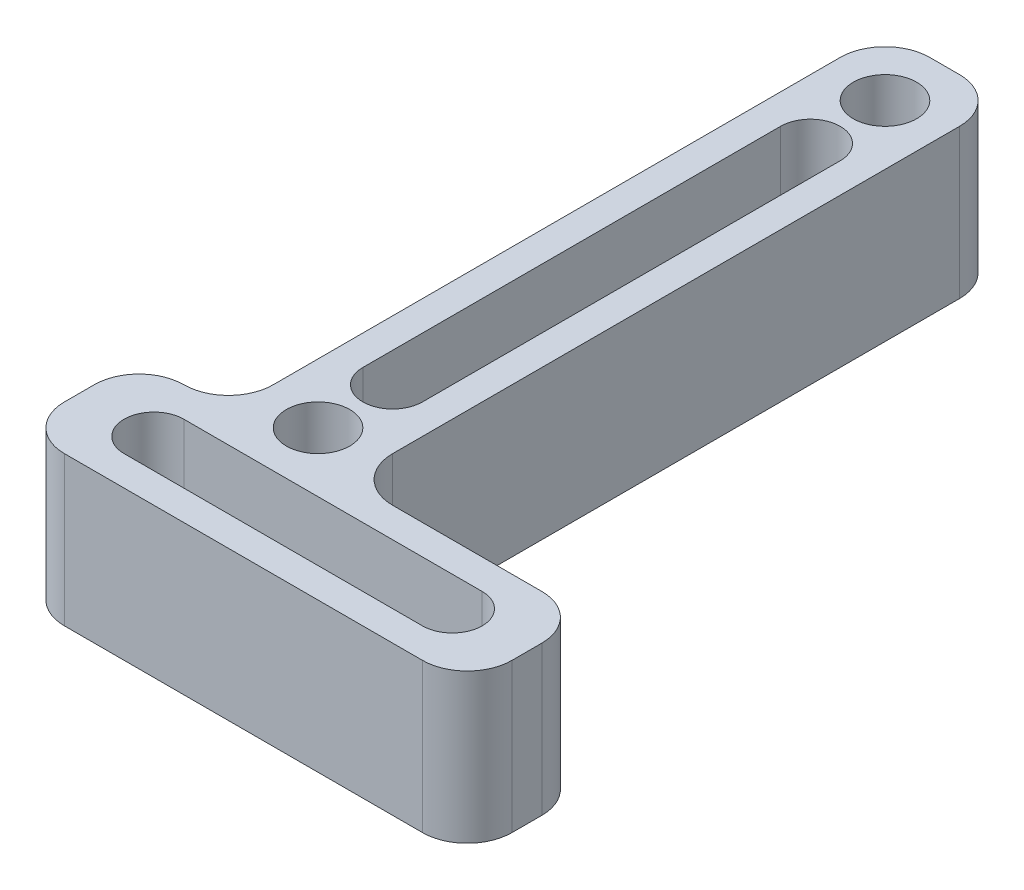
ISO-10303-21;
HEADER;
FILE_DESCRIPTION(('STEP AP214'),'2;1');
FILE_NAME('part.step','',(''),(''),'','','');
FILE_SCHEMA(('AUTOMOTIVE_DESIGN { 1 0 10303 214 1 1 1 1 }'));
ENDSEC;
DATA;
#1=APPLICATION_CONTEXT('core data for automotive mechanical design processes');
#2=APPLICATION_PROTOCOL_DEFINITION('international standard','automotive_design',2000,#1);
#3=PRODUCT_CONTEXT('',#1,'mechanical');
#4=PRODUCT('Part','Part','',(#3));
#5=PRODUCT_RELATED_PRODUCT_CATEGORY('part','',(#4));
#6=PRODUCT_DEFINITION_FORMATION('','',#4);
#7=PRODUCT_DEFINITION_CONTEXT('part definition',#1,'design');
#8=PRODUCT_DEFINITION('design','',#6,#7);
#9=PRODUCT_DEFINITION_SHAPE('','',#8);
#10=(LENGTH_UNIT() NAMED_UNIT(*) SI_UNIT(.MILLI.,.METRE.));
#11=(NAMED_UNIT(*) PLANE_ANGLE_UNIT() SI_UNIT($,.RADIAN.));
#12=(NAMED_UNIT(*) SI_UNIT($,.STERADIAN.) SOLID_ANGLE_UNIT());
#13=UNCERTAINTY_MEASURE_WITH_UNIT(LENGTH_MEASURE(1.E-05),#10,'distance_accuracy_value','');
#14=(GEOMETRIC_REPRESENTATION_CONTEXT(3) GLOBAL_UNCERTAINTY_ASSIGNED_CONTEXT((#13)) GLOBAL_UNIT_ASSIGNED_CONTEXT((#10,
#11,#12)) REPRESENTATION_CONTEXT('',''));
#15=CARTESIAN_POINT('',(0.,0.,0.));
#16=DIRECTION('',(0.,0.,1.));
#17=DIRECTION('',(1.,0.,0.));
#18=AXIS2_PLACEMENT_3D('',#15,#16,#17);
#19=CARTESIAN_POINT('',(-8.,20.,44.));
#20=DIRECTION('',(1.,0.,0.));
#21=DIRECTION('',(0.,0.,-1.));
#22=AXIS2_PLACEMENT_3D('',#19,#20,#21);
#23=PLANE('',#22);
#24=DIRECTION('',(0.,0.,1.));
#25=VECTOR('',#24,1.);
#26=CARTESIAN_POINT('',(-8.,20.,44.));
#27=LINE('',#26,#25);
#28=CARTESIAN_POINT('',(-8.,20.,-38.));
#29=VERTEX_POINT('',#28);
#30=CARTESIAN_POINT('',(-8.,20.,38.));
#31=VERTEX_POINT('',#30);
#32=EDGE_CURVE('E269',#29,#31,#27,.T.);
#33=ORIENTED_EDGE('',*,*,#32,.F.);
#34=DIRECTION('',(0.,-1.,0.));
#35=VECTOR('',#34,1.);
#36=CARTESIAN_POINT('',(-8.,20.,-38.));
#37=LINE('',#36,#35);
#38=CARTESIAN_POINT('',(-8.,0.,-38.));
#39=VERTEX_POINT('',#38);
#40=EDGE_CURVE('E378',#29,#39,#37,.T.);
#41=ORIENTED_EDGE('',*,*,#40,.T.);
#42=DIRECTION('',(0.,0.,1.));
#43=VECTOR('',#42,1.);
#44=CARTESIAN_POINT('',(-8.,0.,44.));
#45=LINE('',#44,#43);
#46=CARTESIAN_POINT('',(-8.,0.,38.));
#47=VERTEX_POINT('',#46);
#48=EDGE_CURVE('E265',#39,#47,#45,.T.);
#49=ORIENTED_EDGE('',*,*,#48,.T.);
#50=DIRECTION('',(0.,-1.,0.));
#51=VECTOR('',#50,1.);
#52=CARTESIAN_POINT('',(-8.,20.,38.));
#53=LINE('',#52,#51);
#54=EDGE_CURVE('E375',#47,#31,#53,.F.);
#55=ORIENTED_EDGE('',*,*,#54,.T.);
#56=EDGE_LOOP('',(#33,#41,#49,#55));
#57=FACE_BOUND('',#56,.T.);
#58=ADVANCED_FACE('F39',(#57),#23,.F.);
#59=CARTESIAN_POINT('',(-20.,20.,60.));
#60=DIRECTION('',(1.,0.,0.));
#61=DIRECTION('',(0.,0.,-1.));
#62=AXIS2_PLACEMENT_3D('',#59,#60,#61);
#63=PLANE('',#62);
#64=DIRECTION('',(0.,0.,1.));
#65=VECTOR('',#64,1.);
#66=CARTESIAN_POINT('',(-20.,0.,60.));
#67=LINE('',#66,#65);
#68=CARTESIAN_POINT('',(-20.,0.,50.));
#69=VERTEX_POINT('',#68);
#70=CARTESIAN_POINT('',(-20.,0.,54.));
#71=VERTEX_POINT('',#70);
#72=EDGE_CURVE('E294',#69,#71,#67,.T.);
#73=ORIENTED_EDGE('',*,*,#72,.T.);
#74=DIRECTION('',(0.,-1.,0.));
#75=VECTOR('',#74,1.);
#76=CARTESIAN_POINT('',(-20.,20.,54.));
#77=LINE('',#76,#75);
#78=CARTESIAN_POINT('',(-20.,20.,54.));
#79=VERTEX_POINT('',#78);
#80=EDGE_CURVE('E358',#71,#79,#77,.F.);
#81=ORIENTED_EDGE('',*,*,#80,.T.);
#82=DIRECTION('',(0.,0.,1.));
#83=VECTOR('',#82,1.);
#84=CARTESIAN_POINT('',(-20.,20.,60.));
#85=LINE('',#84,#83);
#86=CARTESIAN_POINT('',(-20.,20.,50.));
#87=VERTEX_POINT('',#86);
#88=EDGE_CURVE('E272',#87,#79,#85,.T.);
#89=ORIENTED_EDGE('',*,*,#88,.F.);
#90=DIRECTION('',(0.,-1.,0.));
#91=VECTOR('',#90,1.);
#92=CARTESIAN_POINT('',(-20.,20.,50.));
#93=LINE('',#92,#91);
#94=EDGE_CURVE('E356',#87,#69,#93,.T.);
#95=ORIENTED_EDGE('',*,*,#94,.T.);
#96=EDGE_LOOP('',(#73,#81,#89,#95));
#97=FACE_BOUND('',#96,.T.);
#98=ADVANCED_FACE('F406',(#97),#63,.F.);
#99=CARTESIAN_POINT('',(40.,20.,60.));
#100=DIRECTION('',(0.,0.,-1.));
#101=DIRECTION('',(-1.,0.,0.));
#102=AXIS2_PLACEMENT_3D('',#99,#100,#101);
#103=PLANE('',#102);
#104=DIRECTION('',(1.,0.,0.));
#105=VECTOR('',#104,1.);
#106=CARTESIAN_POINT('',(40.,0.,60.));
#107=LINE('',#106,#105);
#108=CARTESIAN_POINT('',(-14.,0.,60.));
#109=VERTEX_POINT('',#108);
#110=CARTESIAN_POINT('',(34.,0.,60.));
#111=VERTEX_POINT('',#110);
#112=EDGE_CURVE('E297',#109,#111,#107,.T.);
#113=ORIENTED_EDGE('',*,*,#112,.T.);
#114=DIRECTION('',(0.,-1.,0.));
#115=VECTOR('',#114,1.);
#116=CARTESIAN_POINT('',(34.,20.,60.));
#117=LINE('',#116,#115);
#118=CARTESIAN_POINT('',(34.,20.,60.));
#119=VERTEX_POINT('',#118);
#120=EDGE_CURVE('E342',#111,#119,#117,.F.);
#121=ORIENTED_EDGE('',*,*,#120,.T.);
#122=DIRECTION('',(1.,0.,0.));
#123=VECTOR('',#122,1.);
#124=CARTESIAN_POINT('',(40.,20.,60.));
#125=LINE('',#124,#123);
#126=CARTESIAN_POINT('',(-14.,20.,60.));
#127=VERTEX_POINT('',#126);
#128=EDGE_CURVE('E276',#127,#119,#125,.T.);
#129=ORIENTED_EDGE('',*,*,#128,.F.);
#130=DIRECTION('',(0.,-1.,0.));
#131=VECTOR('',#130,1.);
#132=CARTESIAN_POINT('',(-14.,20.,60.));
#133=LINE('',#132,#131);
#134=EDGE_CURVE('E339',#127,#109,#133,.T.);
#135=ORIENTED_EDGE('',*,*,#134,.T.);
#136=EDGE_LOOP('',(#113,#121,#129,#135));
#137=FACE_BOUND('',#136,.T.);
#138=ADVANCED_FACE('F415',(#137),#103,.F.);
#139=CARTESIAN_POINT('',(40.,20.,44.));
#140=DIRECTION('',(-1.,0.,0.));
#141=DIRECTION('',(0.,0.,1.));
#142=AXIS2_PLACEMENT_3D('',#139,#140,#141);
#143=PLANE('',#142);
#144=DIRECTION('',(0.,0.,-1.));
#145=VECTOR('',#144,1.);
#146=CARTESIAN_POINT('',(40.,20.,44.));
#147=LINE('',#146,#145);
#148=CARTESIAN_POINT('',(40.,20.,54.));
#149=VERTEX_POINT('',#148);
#150=CARTESIAN_POINT('',(40.,20.,50.));
#151=VERTEX_POINT('',#150);
#152=EDGE_CURVE('E279',#149,#151,#147,.T.);
#153=ORIENTED_EDGE('',*,*,#152,.F.);
#154=DIRECTION('',(0.,-1.,0.));
#155=VECTOR('',#154,1.);
#156=CARTESIAN_POINT('',(40.,20.,54.));
#157=LINE('',#156,#155);
#158=CARTESIAN_POINT('',(40.,0.,54.));
#159=VERTEX_POINT('',#158);
#160=EDGE_CURVE('E324',#149,#159,#157,.T.);
#161=ORIENTED_EDGE('',*,*,#160,.T.);
#162=DIRECTION('',(0.,0.,-1.));
#163=VECTOR('',#162,1.);
#164=CARTESIAN_POINT('',(40.,0.,44.));
#165=LINE('',#164,#163);
#166=CARTESIAN_POINT('',(40.,0.,50.));
#167=VERTEX_POINT('',#166);
#168=EDGE_CURVE('E300',#159,#167,#165,.T.);
#169=ORIENTED_EDGE('',*,*,#168,.T.);
#170=DIRECTION('',(0.,-1.,0.));
#171=VECTOR('',#170,1.);
#172=CARTESIAN_POINT('',(40.,20.,50.));
#173=LINE('',#172,#171);
#174=EDGE_CURVE('E322',#167,#151,#173,.F.);
#175=ORIENTED_EDGE('',*,*,#174,.T.);
#176=EDGE_LOOP('',(#153,#161,#169,#175));
#177=FACE_BOUND('',#176,.T.);
#178=ADVANCED_FACE('F423',(#177),#143,.F.);
#179=CARTESIAN_POINT('',(8.,20.,44.));
#180=DIRECTION('',(0.,0.,1.));
#181=DIRECTION('',(1.,0.,0.));
#182=AXIS2_PLACEMENT_3D('',#179,#180,#181);
#183=PLANE('',#182);
#184=DIRECTION('',(-1.,0.,0.));
#185=VECTOR('',#184,1.);
#186=CARTESIAN_POINT('',(8.,20.,44.));
#187=LINE('',#186,#185);
#188=CARTESIAN_POINT('',(34.,20.,44.));
#189=VERTEX_POINT('',#188);
#190=CARTESIAN_POINT('',(14.,20.,44.));
#191=VERTEX_POINT('',#190);
#192=EDGE_CURVE('E282',#189,#191,#187,.T.);
#193=ORIENTED_EDGE('',*,*,#192,.F.);
#194=DIRECTION('',(0.,-1.,0.));
#195=VECTOR('',#194,1.);
#196=CARTESIAN_POINT('',(34.,20.,44.));
#197=LINE('',#196,#195);
#198=CARTESIAN_POINT('',(34.,0.,44.));
#199=VERTEX_POINT('',#198);
#200=EDGE_CURVE('E362',#189,#199,#197,.T.);
#201=ORIENTED_EDGE('',*,*,#200,.T.);
#202=DIRECTION('',(-1.,0.,0.));
#203=VECTOR('',#202,1.);
#204=CARTESIAN_POINT('',(8.,0.,44.));
#205=LINE('',#204,#203);
#206=CARTESIAN_POINT('',(14.,0.,44.));
#207=VERTEX_POINT('',#206);
#208=EDGE_CURVE('E303',#199,#207,#205,.T.);
#209=ORIENTED_EDGE('',*,*,#208,.T.);
#210=DIRECTION('',(0.,-1.,0.));
#211=VECTOR('',#210,1.);
#212=CARTESIAN_POINT('',(14.,20.,44.));
#213=LINE('',#212,#211);
#214=EDGE_CURVE('E360',#207,#191,#213,.F.);
#215=ORIENTED_EDGE('',*,*,#214,.T.);
#216=EDGE_LOOP('',(#193,#201,#209,#215));
#217=FACE_BOUND('',#216,.T.);
#218=ADVANCED_FACE('F432',(#217),#183,.F.);
#219=CARTESIAN_POINT('',(8.,20.,-44.));
#220=DIRECTION('',(-1.,0.,0.));
#221=DIRECTION('',(0.,0.,1.));
#222=AXIS2_PLACEMENT_3D('',#219,#220,#221);
#223=PLANE('',#222);
#224=DIRECTION('',(0.,0.,-1.));
#225=VECTOR('',#224,1.);
#226=CARTESIAN_POINT('',(8.,20.,-44.));
#227=LINE('',#226,#225);
#228=CARTESIAN_POINT('',(8.,20.,38.));
#229=VERTEX_POINT('',#228);
#230=CARTESIAN_POINT('',(8.,20.,-38.));
#231=VERTEX_POINT('',#230);
#232=EDGE_CURVE('E285',#229,#231,#227,.T.);
#233=ORIENTED_EDGE('',*,*,#232,.F.);
#234=DIRECTION('',(0.,-1.,0.));
#235=VECTOR('',#234,1.);
#236=CARTESIAN_POINT('',(8.,0.,38.));
#237=LINE('',#236,#235);
#238=CARTESIAN_POINT('',(8.,0.,38.));
#239=VERTEX_POINT('',#238);
#240=EDGE_CURVE('E367',#229,#239,#237,.T.);
#241=ORIENTED_EDGE('',*,*,#240,.T.);
#242=DIRECTION('',(0.,0.,-1.));
#243=VECTOR('',#242,1.);
#244=CARTESIAN_POINT('',(8.,0.,-44.));
#245=LINE('',#244,#243);
#246=CARTESIAN_POINT('',(8.,0.,-38.));
#247=VERTEX_POINT('',#246);
#248=EDGE_CURVE('E306',#239,#247,#245,.T.);
#249=ORIENTED_EDGE('',*,*,#248,.T.);
#250=DIRECTION('',(0.,-1.,0.));
#251=VECTOR('',#250,1.);
#252=CARTESIAN_POINT('',(8.,20.,-38.));
#253=LINE('',#252,#251);
#254=EDGE_CURVE('E365',#247,#231,#253,.F.);
#255=ORIENTED_EDGE('',*,*,#254,.T.);
#256=EDGE_LOOP('',(#233,#241,#249,#255));
#257=FACE_BOUND('',#256,.T.);
#258=ADVANCED_FACE('F441',(#257),#223,.F.);
#259=CARTESIAN_POINT('',(-8.,20.,-44.));
#260=DIRECTION('',(0.,0.,1.));
#261=DIRECTION('',(1.,0.,0.));
#262=AXIS2_PLACEMENT_3D('',#259,#260,#261);
#263=PLANE('',#262);
#264=DIRECTION('',(-1.,0.,0.));
#265=VECTOR('',#264,1.);
#266=CARTESIAN_POINT('',(-8.,20.,-44.));
#267=LINE('',#266,#265);
#268=CARTESIAN_POINT('',(1.99999999999999,20.,-44.));
#269=VERTEX_POINT('',#268);
#270=CARTESIAN_POINT('',(-2.00000000000001,20.,-44.));
#271=VERTEX_POINT('',#270);
#272=EDGE_CURVE('E288',#269,#271,#267,.T.);
#273=ORIENTED_EDGE('',*,*,#272,.F.);
#274=DIRECTION('',(0.,-1.,0.));
#275=VECTOR('',#274,1.);
#276=CARTESIAN_POINT('',(1.99999999999999,20.,-44.));
#277=LINE('',#276,#275);
#278=CARTESIAN_POINT('',(1.99999999999999,0.,-44.));
#279=VERTEX_POINT('',#278);
#280=EDGE_CURVE('E372',#269,#279,#277,.T.);
#281=ORIENTED_EDGE('',*,*,#280,.T.);
#282=DIRECTION('',(-1.,0.,0.));
#283=VECTOR('',#282,1.);
#284=CARTESIAN_POINT('',(-8.,0.,-44.));
#285=LINE('',#284,#283);
#286=CARTESIAN_POINT('',(-2.00000000000001,0.,-44.));
#287=VERTEX_POINT('',#286);
#288=EDGE_CURVE('E273',#279,#287,#285,.T.);
#289=ORIENTED_EDGE('',*,*,#288,.T.);
#290=DIRECTION('',(0.,-1.,0.));
#291=VECTOR('',#290,1.);
#292=CARTESIAN_POINT('',(-2.00000000000001,20.,-44.));
#293=LINE('',#292,#291);
#294=EDGE_CURVE('E370',#287,#271,#293,.F.);
#295=ORIENTED_EDGE('',*,*,#294,.T.);
#296=EDGE_LOOP('',(#273,#281,#289,#295));
#297=FACE_BOUND('',#296,.T.);
#298=ADVANCED_FACE('F450',(#297),#263,.F.);
#299=CARTESIAN_POINT('',(0.,20.,0.));
#300=DIRECTION('',(0.,-1.,0.));
#301=DIRECTION('',(0.,0.,-1.));
#302=AXIS2_PLACEMENT_3D('',#299,#300,#301);
#303=PLANE('',#302);
#304=DIRECTION('',(1.,0.,0.));
#305=VECTOR('',#304,1.);
#306=CARTESIAN_POINT('',(-10.,20.,56.));
#307=LINE('',#306,#305);
#308=CARTESIAN_POINT('',(-10.,20.,56.));
#309=VERTEX_POINT('',#308);
#310=CARTESIAN_POINT('',(30.,20.,56.));
#311=VERTEX_POINT('',#310);
#312=EDGE_CURVE('E221',#309,#311,#307,.T.);
#313=ORIENTED_EDGE('',*,*,#312,.F.);
#314=CARTESIAN_POINT('',(-10.,20.,52.));
#315=DIRECTION('',(0.,1.,0.));
#316=DIRECTION('',(0.,0.,1.));
#317=AXIS2_PLACEMENT_3D('',#314,#315,#316);
#318=CIRCLE('',#317,3.99999999999999);
#319=CARTESIAN_POINT('',(-10.,20.,48.));
#320=VERTEX_POINT('',#319);
#321=EDGE_CURVE('E55',#320,#309,#318,.T.);
#322=ORIENTED_EDGE('',*,*,#321,.F.);
#323=DIRECTION('',(-1.,0.,0.));
#324=VECTOR('',#323,1.);
#325=CARTESIAN_POINT('',(-10.,20.,48.));
#326=LINE('',#325,#324);
#327=CARTESIAN_POINT('',(30.,20.,48.));
#328=VERTEX_POINT('',#327);
#329=EDGE_CURVE('E212',#328,#320,#326,.T.);
#330=ORIENTED_EDGE('',*,*,#329,.F.);
#331=CARTESIAN_POINT('',(30.,20.,52.));
#332=DIRECTION('',(0.,1.,0.));
#333=DIRECTION('',(0.,0.,1.));
#334=AXIS2_PLACEMENT_3D('',#331,#332,#333);
#335=CIRCLE('',#334,3.99999999999999);
#336=EDGE_CURVE('E215',#311,#328,#335,.T.);
#337=ORIENTED_EDGE('',*,*,#336,.F.);
#338=EDGE_LOOP('',(#313,#322,#330,#337));
#339=FACE_BOUND('',#338,.T.);
#340=DIRECTION('',(0.,0.,1.));
#341=VECTOR('',#340,1.);
#342=CARTESIAN_POINT('',(-3.99999999999999,20.,-26.));
#343=LINE('',#342,#341);
#344=CARTESIAN_POINT('',(-3.99999999999999,20.,-26.));
#345=VERTEX_POINT('',#344);
#346=CARTESIAN_POINT('',(-3.99999999999999,20.,30.));
#347=VERTEX_POINT('',#346);
#348=EDGE_CURVE('E246',#345,#347,#343,.T.);
#349=ORIENTED_EDGE('',*,*,#348,.F.);
#350=CARTESIAN_POINT('',(0.,20.,-26.));
#351=DIRECTION('',(0.,1.,0.));
#352=DIRECTION('',(0.,0.,1.));
#353=AXIS2_PLACEMENT_3D('',#350,#351,#352);
#354=CIRCLE('',#353,4.);
#355=CARTESIAN_POINT('',(4.,20.,-26.));
#356=VERTEX_POINT('',#355);
#357=EDGE_CURVE('E227',#356,#345,#354,.T.);
#358=ORIENTED_EDGE('',*,*,#357,.F.);
#359=DIRECTION('',(0.,0.,-1.));
#360=VECTOR('',#359,1.);
#361=CARTESIAN_POINT('',(4.,20.,-26.));
#362=LINE('',#361,#360);
#363=CARTESIAN_POINT('',(4.00000000000001,20.,30.));
#364=VERTEX_POINT('',#363);
#365=EDGE_CURVE('E235',#364,#356,#362,.T.);
#366=ORIENTED_EDGE('',*,*,#365,.F.);
#367=CARTESIAN_POINT('',(0.,20.,30.));
#368=DIRECTION('',(0.,1.,0.));
#369=DIRECTION('',(0.,0.,1.));
#370=AXIS2_PLACEMENT_3D('',#367,#368,#369);
#371=CIRCLE('',#370,4.);
#372=EDGE_CURVE('E249',#347,#364,#371,.T.);
#373=ORIENTED_EDGE('',*,*,#372,.F.);
#374=EDGE_LOOP('',(#349,#358,#366,#373));
#375=FACE_BOUND('',#374,.T.);
#376=CARTESIAN_POINT('',(0.,20.,-36.));
#377=DIRECTION('',(0.,1.,0.));
#378=DIRECTION('',(0.,0.,1.));
#379=AXIS2_PLACEMENT_3D('',#376,#377,#378);
#380=CIRCLE('',#379,4.25000000000001);
#381=CARTESIAN_POINT('',(0.,20.,-31.75));
#382=VERTEX_POINT('',#381);
#383=EDGE_CURVE('E262',#382,#382,#380,.T.);
#384=ORIENTED_EDGE('',*,*,#383,.F.);
#385=EDGE_LOOP('',(#384));
#386=FACE_BOUND('',#385,.T.);
#387=CARTESIAN_POINT('',(0.,20.,40.));
#388=DIRECTION('',(0.,1.,0.));
#389=DIRECTION('',(0.,0.,1.));
#390=AXIS2_PLACEMENT_3D('',#387,#388,#389);
#391=CIRCLE('',#390,4.25);
#392=CARTESIAN_POINT('',(0.,20.,44.25));
#393=VERTEX_POINT('',#392);
#394=EDGE_CURVE('E266',#393,#393,#391,.T.);
#395=ORIENTED_EDGE('',*,*,#394,.F.);
#396=EDGE_LOOP('',(#395));
#397=FACE_BOUND('',#396,.T.);
#398=ORIENTED_EDGE('',*,*,#128,.T.);
#399=CARTESIAN_POINT('',(34.,20.,54.));
#400=DIRECTION('',(0.,-1.,0.));
#401=DIRECTION('',(0.,0.,-1.));
#402=AXIS2_PLACEMENT_3D('',#399,#400,#401);
#403=CIRCLE('',#402,6.);
#404=EDGE_CURVE('E354',#119,#149,#403,.F.);
#405=ORIENTED_EDGE('',*,*,#404,.T.);
#406=ORIENTED_EDGE('',*,*,#152,.T.);
#407=CARTESIAN_POINT('',(34.,20.,50.));
#408=DIRECTION('',(0.,-1.,0.));
#409=DIRECTION('',(0.,0.,-1.));
#410=AXIS2_PLACEMENT_3D('',#407,#408,#409);
#411=CIRCLE('',#410,6.);
#412=EDGE_CURVE('E350',#151,#189,#411,.F.);
#413=ORIENTED_EDGE('',*,*,#412,.T.);
#414=ORIENTED_EDGE('',*,*,#192,.T.);
#415=CARTESIAN_POINT('',(14.,20.,38.));
#416=DIRECTION('',(0.,-1.,0.));
#417=DIRECTION('',(0.,0.,-1.));
#418=AXIS2_PLACEMENT_3D('',#415,#416,#417);
#419=CIRCLE('',#418,6.);
#420=EDGE_CURVE('E383',#191,#229,#419,.T.);
#421=ORIENTED_EDGE('',*,*,#420,.T.);
#422=ORIENTED_EDGE('',*,*,#232,.T.);
#423=CARTESIAN_POINT('',(2.,20.,-38.));
#424=DIRECTION('',(0.,-1.,0.));
#425=DIRECTION('',(0.,0.,-1.));
#426=AXIS2_PLACEMENT_3D('',#423,#424,#425);
#427=CIRCLE('',#426,6.);
#428=EDGE_CURVE('E348',#231,#269,#427,.F.);
#429=ORIENTED_EDGE('',*,*,#428,.T.);
#430=ORIENTED_EDGE('',*,*,#272,.T.);
#431=CARTESIAN_POINT('',(-2.,20.,-38.));
#432=DIRECTION('',(0.,-1.,0.));
#433=DIRECTION('',(0.,0.,-1.));
#434=AXIS2_PLACEMENT_3D('',#431,#432,#433);
#435=CIRCLE('',#434,6.);
#436=EDGE_CURVE('E346',#271,#29,#435,.F.);
#437=ORIENTED_EDGE('',*,*,#436,.T.);
#438=ORIENTED_EDGE('',*,*,#32,.T.);
#439=CARTESIAN_POINT('',(-14.,20.,38.));
#440=DIRECTION('',(0.,-1.,0.));
#441=DIRECTION('',(0.,0.,-1.));
#442=AXIS2_PLACEMENT_3D('',#439,#440,#441);
#443=CIRCLE('',#442,6.);
#444=CARTESIAN_POINT('',(-14.,20.,44.));
#445=VERTEX_POINT('',#444);
#446=EDGE_CURVE('E11',#31,#445,#443,.T.);
#447=ORIENTED_EDGE('',*,*,#446,.T.);
#448=CARTESIAN_POINT('',(-14.,20.,50.));
#449=DIRECTION('',(0.,-1.,0.));
#450=DIRECTION('',(0.,0.,-1.));
#451=AXIS2_PLACEMENT_3D('',#448,#449,#450);
#452=CIRCLE('',#451,6.);
#453=EDGE_CURVE('E344',#445,#87,#452,.F.);
#454=ORIENTED_EDGE('',*,*,#453,.T.);
#455=ORIENTED_EDGE('',*,*,#88,.T.);
#456=CARTESIAN_POINT('',(-14.,20.,54.));
#457=DIRECTION('',(0.,-1.,0.));
#458=DIRECTION('',(0.,0.,-1.));
#459=AXIS2_PLACEMENT_3D('',#456,#457,#458);
#460=CIRCLE('',#459,6.);
#461=EDGE_CURVE('E352',#79,#127,#460,.F.);
#462=ORIENTED_EDGE('',*,*,#461,.T.);
#463=EDGE_LOOP('',(#398,#405,#406,#413,#414,#421,#422,#429,#430,#437,#438,#447,#454,#455,#462));
#464=FACE_BOUND('',#463,.T.);
#465=ADVANCED_FACE('F401',(#339,#375,#386,#397,#464),#303,.F.);
#466=CARTESIAN_POINT('',(0.,0.,0.));
#467=DIRECTION('',(0.,-1.,0.));
#468=DIRECTION('',(0.,0.,-1.));
#469=AXIS2_PLACEMENT_3D('',#466,#467,#468);
#470=PLANE('',#469);
#471=CARTESIAN_POINT('',(-10.,0.,52.));
#472=DIRECTION('',(0.,1.,0.));
#473=DIRECTION('',(0.,0.,1.));
#474=AXIS2_PLACEMENT_3D('',#471,#472,#473);
#475=CIRCLE('',#474,3.99999999999999);
#476=CARTESIAN_POINT('',(-10.,0.,48.));
#477=VERTEX_POINT('',#476);
#478=CARTESIAN_POINT('',(-10.,0.,56.));
#479=VERTEX_POINT('',#478);
#480=EDGE_CURVE('E196',#477,#479,#475,.T.);
#481=ORIENTED_EDGE('',*,*,#480,.T.);
#482=DIRECTION('',(1.,0.,0.));
#483=VECTOR('',#482,1.);
#484=CARTESIAN_POINT('',(-10.,0.,56.));
#485=LINE('',#484,#483);
#486=CARTESIAN_POINT('',(30.,0.,56.));
#487=VERTEX_POINT('',#486);
#488=EDGE_CURVE('E205',#479,#487,#485,.T.);
#489=ORIENTED_EDGE('',*,*,#488,.T.);
#490=CARTESIAN_POINT('',(30.,0.,52.));
#491=DIRECTION('',(0.,1.,0.));
#492=DIRECTION('',(0.,0.,1.));
#493=AXIS2_PLACEMENT_3D('',#490,#491,#492);
#494=CIRCLE('',#493,3.99999999999999);
#495=CARTESIAN_POINT('',(30.,0.,48.));
#496=VERTEX_POINT('',#495);
#497=EDGE_CURVE('E63',#487,#496,#494,.T.);
#498=ORIENTED_EDGE('',*,*,#497,.T.);
#499=DIRECTION('',(-1.,0.,0.));
#500=VECTOR('',#499,1.);
#501=CARTESIAN_POINT('',(-10.,0.,48.));
#502=LINE('',#501,#500);
#503=EDGE_CURVE('E202',#496,#477,#502,.T.);
#504=ORIENTED_EDGE('',*,*,#503,.T.);
#505=EDGE_LOOP('',(#481,#489,#498,#504));
#506=FACE_BOUND('',#505,.T.);
#507=CARTESIAN_POINT('',(0.,0.,-26.));
#508=DIRECTION('',(0.,1.,0.));
#509=DIRECTION('',(0.,0.,1.));
#510=AXIS2_PLACEMENT_3D('',#507,#508,#509);
#511=CIRCLE('',#510,4.);
#512=CARTESIAN_POINT('',(4.,0.,-26.));
#513=VERTEX_POINT('',#512);
#514=CARTESIAN_POINT('',(-3.99999999999999,0.,-26.));
#515=VERTEX_POINT('',#514);
#516=EDGE_CURVE('E231',#513,#515,#511,.T.);
#517=ORIENTED_EDGE('',*,*,#516,.T.);
#518=DIRECTION('',(0.,0.,1.));
#519=VECTOR('',#518,1.);
#520=CARTESIAN_POINT('',(-3.99999999999999,0.,-26.));
#521=LINE('',#520,#519);
#522=CARTESIAN_POINT('',(-3.99999999999999,0.,30.));
#523=VERTEX_POINT('',#522);
#524=EDGE_CURVE('E234',#515,#523,#521,.T.);
#525=ORIENTED_EDGE('',*,*,#524,.T.);
#526=CARTESIAN_POINT('',(0.,0.,30.));
#527=DIRECTION('',(0.,1.,0.));
#528=DIRECTION('',(0.,0.,1.));
#529=AXIS2_PLACEMENT_3D('',#526,#527,#528);
#530=CIRCLE('',#529,4.);
#531=CARTESIAN_POINT('',(4.00000000000001,0.,30.));
#532=VERTEX_POINT('',#531);
#533=EDGE_CURVE('E238',#523,#532,#530,.T.);
#534=ORIENTED_EDGE('',*,*,#533,.T.);
#535=DIRECTION('',(0.,0.,-1.));
#536=VECTOR('',#535,1.);
#537=CARTESIAN_POINT('',(4.,0.,-26.));
#538=LINE('',#537,#536);
#539=EDGE_CURVE('E241',#532,#513,#538,.T.);
#540=ORIENTED_EDGE('',*,*,#539,.T.);
#541=EDGE_LOOP('',(#517,#525,#534,#540));
#542=FACE_BOUND('',#541,.T.);
#543=ORIENTED_EDGE('',*,*,#168,.F.);
#544=CARTESIAN_POINT('',(34.,0.,54.));
#545=DIRECTION('',(0.,-1.,0.));
#546=DIRECTION('',(0.,0.,-1.));
#547=AXIS2_PLACEMENT_3D('',#544,#545,#546);
#548=CIRCLE('',#547,6.);
#549=EDGE_CURVE('E337',#159,#111,#548,.T.);
#550=ORIENTED_EDGE('',*,*,#549,.T.);
#551=ORIENTED_EDGE('',*,*,#112,.F.);
#552=CARTESIAN_POINT('',(-14.,0.,54.));
#553=DIRECTION('',(0.,-1.,0.));
#554=DIRECTION('',(0.,0.,-1.));
#555=AXIS2_PLACEMENT_3D('',#552,#553,#554);
#556=CIRCLE('',#555,6.);
#557=EDGE_CURVE('E335',#109,#71,#556,.T.);
#558=ORIENTED_EDGE('',*,*,#557,.T.);
#559=ORIENTED_EDGE('',*,*,#72,.F.);
#560=CARTESIAN_POINT('',(-14.,0.,50.));
#561=DIRECTION('',(0.,-1.,0.));
#562=DIRECTION('',(0.,0.,-1.));
#563=AXIS2_PLACEMENT_3D('',#560,#561,#562);
#564=CIRCLE('',#563,6.);
#565=CARTESIAN_POINT('',(-14.,0.,44.));
#566=VERTEX_POINT('',#565);
#567=EDGE_CURVE('E327',#69,#566,#564,.T.);
#568=ORIENTED_EDGE('',*,*,#567,.T.);
#569=CARTESIAN_POINT('',(-14.,0.,38.));
#570=DIRECTION('',(0.,-1.,0.));
#571=DIRECTION('',(0.,0.,-1.));
#572=AXIS2_PLACEMENT_3D('',#569,#570,#571);
#573=CIRCLE('',#572,6.);
#574=EDGE_CURVE('E48',#566,#47,#573,.F.);
#575=ORIENTED_EDGE('',*,*,#574,.T.);
#576=ORIENTED_EDGE('',*,*,#48,.F.);
#577=CARTESIAN_POINT('',(-2.,0.,-38.));
#578=DIRECTION('',(0.,-1.,0.));
#579=DIRECTION('',(0.,0.,-1.));
#580=AXIS2_PLACEMENT_3D('',#577,#578,#579);
#581=CIRCLE('',#580,6.);
#582=EDGE_CURVE('E329',#39,#287,#581,.T.);
#583=ORIENTED_EDGE('',*,*,#582,.T.);
#584=ORIENTED_EDGE('',*,*,#288,.F.);
#585=CARTESIAN_POINT('',(2.,0.,-38.));
#586=DIRECTION('',(0.,-1.,0.));
#587=DIRECTION('',(0.,0.,-1.));
#588=AXIS2_PLACEMENT_3D('',#585,#586,#587);
#589=CIRCLE('',#588,6.);
#590=EDGE_CURVE('E331',#279,#247,#589,.T.);
#591=ORIENTED_EDGE('',*,*,#590,.T.);
#592=ORIENTED_EDGE('',*,*,#248,.F.);
#593=CARTESIAN_POINT('',(14.,0.,38.));
#594=DIRECTION('',(0.,-1.,0.));
#595=DIRECTION('',(0.,0.,-1.));
#596=AXIS2_PLACEMENT_3D('',#593,#594,#595);
#597=CIRCLE('',#596,6.);
#598=EDGE_CURVE('E381',#239,#207,#597,.F.);
#599=ORIENTED_EDGE('',*,*,#598,.T.);
#600=ORIENTED_EDGE('',*,*,#208,.F.);
#601=CARTESIAN_POINT('',(34.,0.,50.));
#602=DIRECTION('',(0.,-1.,0.));
#603=DIRECTION('',(0.,0.,-1.));
#604=AXIS2_PLACEMENT_3D('',#601,#602,#603);
#605=CIRCLE('',#604,6.);
#606=EDGE_CURVE('E333',#199,#167,#605,.T.);
#607=ORIENTED_EDGE('',*,*,#606,.T.);
#608=EDGE_LOOP('',(#543,#550,#551,#558,#559,#568,#575,#576,#583,#584,#591,#592,#599,#600,#607));
#609=FACE_BOUND('',#608,.T.);
#610=ADVANCED_FACE('F209',(#506,#542,#609),#470,.T.);
#611=CARTESIAN_POINT('',(0.,2.,40.));
#612=DIRECTION('',(0.,1.,0.));
#613=DIRECTION('',(0.,0.,1.));
#614=AXIS2_PLACEMENT_3D('',#611,#612,#613);
#615=CYLINDRICAL_SURFACE('',#614,4.25);
#616=CARTESIAN_POINT('',(0.,12.0000000000034,40.));
#617=DIRECTION('',(0.,1.,0.));
#618=DIRECTION('',(0.,0.,1.));
#619=AXIS2_PLACEMENT_3D('',#616,#617,#618);
#620=CIRCLE('',#619,4.25);
#621=CARTESIAN_POINT('',(0.,12.0000000000034,44.25));
#622=VERTEX_POINT('',#621);
#623=EDGE_CURVE('E313',#622,#622,#620,.F.);
#624=ORIENTED_EDGE('',*,*,#623,.T.);
#625=EDGE_LOOP('',(#624));
#626=FACE_BOUND('',#625,.T.);
#627=ORIENTED_EDGE('',*,*,#394,.T.);
#628=EDGE_LOOP('',(#627));
#629=FACE_BOUND('',#628,.T.);
#630=ADVANCED_FACE('F588',(#626,#629),#615,.F.);
#631=CARTESIAN_POINT('',(0.,2.,40.));
#632=DIRECTION('',(0.,1.,0.));
#633=DIRECTION('',(0.,0.,1.));
#634=AXIS2_PLACEMENT_3D('',#631,#632,#633);
#635=PLANE('',#634);
#636=CARTESIAN_POINT('',(0.,2.,40.));
#637=DIRECTION('',(0.,1.,0.));
#638=DIRECTION('',(0.,0.,1.));
#639=AXIS2_PLACEMENT_3D('',#636,#637,#638);
#640=CIRCLE('',#639,3.90079230508237);
#641=CARTESIAN_POINT('',(0.,2.,43.9007923050824));
#642=VERTEX_POINT('',#641);
#643=EDGE_CURVE('E291',#642,#642,#640,.T.);
#644=ORIENTED_EDGE('',*,*,#643,.T.);
#645=EDGE_LOOP('',(#644));
#646=FACE_BOUND('',#645,.T.);
#647=ADVANCED_FACE('F692',(#646),#635,.T.);
#648=CARTESIAN_POINT('',(0.,2.,-36.));
#649=DIRECTION('',(0.,1.,0.));
#650=DIRECTION('',(0.,0.,1.));
#651=AXIS2_PLACEMENT_3D('',#648,#649,#650);
#652=CYLINDRICAL_SURFACE('',#651,4.25000000000001);
#653=CARTESIAN_POINT('',(0.,12.0000000000035,-36.));
#654=DIRECTION('',(0.,1.,0.));
#655=DIRECTION('',(0.,0.,1.));
#656=AXIS2_PLACEMENT_3D('',#653,#654,#655);
#657=CIRCLE('',#656,4.25000000000001);
#658=CARTESIAN_POINT('',(0.,12.0000000000035,-31.75));
#659=VERTEX_POINT('',#658);
#660=EDGE_CURVE('E319',#659,#659,#657,.F.);
#661=ORIENTED_EDGE('',*,*,#660,.T.);
#662=EDGE_LOOP('',(#661));
#663=FACE_BOUND('',#662,.T.);
#664=ORIENTED_EDGE('',*,*,#383,.T.);
#665=EDGE_LOOP('',(#664));
#666=FACE_BOUND('',#665,.T.);
#667=ADVANCED_FACE('F682',(#663,#666),#652,.F.);
#668=CARTESIAN_POINT('',(0.,2.,-36.));
#669=DIRECTION('',(0.,1.,0.));
#670=DIRECTION('',(0.,0.,1.));
#671=AXIS2_PLACEMENT_3D('',#668,#669,#670);
#672=PLANE('',#671);
#673=CARTESIAN_POINT('',(0.,2.,-36.));
#674=DIRECTION('',(0.,1.,0.));
#675=DIRECTION('',(0.,0.,1.));
#676=AXIS2_PLACEMENT_3D('',#673,#674,#675);
#677=CIRCLE('',#676,3.90079230508237);
#678=CARTESIAN_POINT('',(0.,2.,-32.0992076949176));
#679=VERTEX_POINT('',#678);
#680=EDGE_CURVE('E316',#679,#679,#677,.T.);
#681=ORIENTED_EDGE('',*,*,#680,.T.);
#682=EDGE_LOOP('',(#681));
#683=FACE_BOUND('',#682,.T.);
#684=ADVANCED_FACE('F478',(#683),#672,.T.);
#685=CARTESIAN_POINT('',(0.,2.,40.));
#686=DIRECTION('',(0.,1.,0.));
#687=DIRECTION('',(0.,0.,1.));
#688=AXIS2_PLACEMENT_3D('',#685,#686,#687);
#689=CONICAL_SURFACE('',#688,3.90079230508237,0.0349065850398902);
#690=ORIENTED_EDGE('',*,*,#623,.F.);
#691=EDGE_LOOP('',(#690));
#692=FACE_BOUND('',#691,.T.);
#693=ORIENTED_EDGE('',*,*,#643,.F.);
#694=EDGE_LOOP('',(#693));
#695=FACE_BOUND('',#694,.T.);
#696=ADVANCED_FACE('F471',(#692,#695),#689,.F.);
#697=CARTESIAN_POINT('',(0.,2.,-36.));
#698=DIRECTION('',(0.,1.,0.));
#699=DIRECTION('',(0.,0.,1.));
#700=AXIS2_PLACEMENT_3D('',#697,#698,#699);
#701=CONICAL_SURFACE('',#700,3.90079230508237,0.0349065850398902);
#702=ORIENTED_EDGE('',*,*,#660,.F.);
#703=EDGE_LOOP('',(#702));
#704=FACE_BOUND('',#703,.T.);
#705=ORIENTED_EDGE('',*,*,#680,.F.);
#706=EDGE_LOOP('',(#705));
#707=FACE_BOUND('',#706,.T.);
#708=ADVANCED_FACE('F477',(#704,#707),#701,.F.);
#709=CARTESIAN_POINT('',(34.,20.,54.));
#710=DIRECTION('',(0.,-1.,0.));
#711=DIRECTION('',(0.,0.,-1.));
#712=AXIS2_PLACEMENT_3D('',#709,#710,#711);
#713=CYLINDRICAL_SURFACE('',#712,6.);
#714=ORIENTED_EDGE('',*,*,#404,.F.);
#715=ORIENTED_EDGE('',*,*,#120,.F.);
#716=ORIENTED_EDGE('',*,*,#549,.F.);
#717=ORIENTED_EDGE('',*,*,#160,.F.);
#718=EDGE_LOOP('',(#714,#715,#716,#717));
#719=FACE_BOUND('',#718,.T.);
#720=ADVANCED_FACE('F421',(#719),#713,.T.);
#721=CARTESIAN_POINT('',(-14.,20.,54.));
#722=DIRECTION('',(0.,-1.,0.));
#723=DIRECTION('',(0.,0.,-1.));
#724=AXIS2_PLACEMENT_3D('',#721,#722,#723);
#725=CYLINDRICAL_SURFACE('',#724,6.);
#726=ORIENTED_EDGE('',*,*,#461,.F.);
#727=ORIENTED_EDGE('',*,*,#80,.F.);
#728=ORIENTED_EDGE('',*,*,#557,.F.);
#729=ORIENTED_EDGE('',*,*,#134,.F.);
#730=EDGE_LOOP('',(#726,#727,#728,#729));
#731=FACE_BOUND('',#730,.T.);
#732=ADVANCED_FACE('F412',(#731),#725,.T.);
#733=CARTESIAN_POINT('',(34.,20.,50.));
#734=DIRECTION('',(0.,-1.,0.));
#735=DIRECTION('',(0.,0.,-1.));
#736=AXIS2_PLACEMENT_3D('',#733,#734,#735);
#737=CYLINDRICAL_SURFACE('',#736,6.);
#738=ORIENTED_EDGE('',*,*,#412,.F.);
#739=ORIENTED_EDGE('',*,*,#174,.F.);
#740=ORIENTED_EDGE('',*,*,#606,.F.);
#741=ORIENTED_EDGE('',*,*,#200,.F.);
#742=EDGE_LOOP('',(#738,#739,#740,#741));
#743=FACE_BOUND('',#742,.T.);
#744=ADVANCED_FACE('F429',(#743),#737,.T.);
#745=CARTESIAN_POINT('',(14.,20.,38.));
#746=DIRECTION('',(0.,1.,0.));
#747=DIRECTION('',(0.,0.,1.));
#748=AXIS2_PLACEMENT_3D('',#745,#746,#747);
#749=CYLINDRICAL_SURFACE('',#748,6.);
#750=ORIENTED_EDGE('',*,*,#420,.F.);
#751=ORIENTED_EDGE('',*,*,#214,.F.);
#752=ORIENTED_EDGE('',*,*,#598,.F.);
#753=ORIENTED_EDGE('',*,*,#240,.F.);
#754=EDGE_LOOP('',(#750,#751,#752,#753));
#755=FACE_BOUND('',#754,.T.);
#756=ADVANCED_FACE('F438',(#755),#749,.F.);
#757=CARTESIAN_POINT('',(2.,20.,-38.));
#758=DIRECTION('',(0.,-1.,0.));
#759=DIRECTION('',(0.,0.,-1.));
#760=AXIS2_PLACEMENT_3D('',#757,#758,#759);
#761=CYLINDRICAL_SURFACE('',#760,6.);
#762=ORIENTED_EDGE('',*,*,#428,.F.);
#763=ORIENTED_EDGE('',*,*,#254,.F.);
#764=ORIENTED_EDGE('',*,*,#590,.F.);
#765=ORIENTED_EDGE('',*,*,#280,.F.);
#766=EDGE_LOOP('',(#762,#763,#764,#765));
#767=FACE_BOUND('',#766,.T.);
#768=ADVANCED_FACE('F447',(#767),#761,.T.);
#769=CARTESIAN_POINT('',(-2.,20.,-38.));
#770=DIRECTION('',(0.,-1.,0.));
#771=DIRECTION('',(0.,0.,-1.));
#772=AXIS2_PLACEMENT_3D('',#769,#770,#771);
#773=CYLINDRICAL_SURFACE('',#772,6.);
#774=ORIENTED_EDGE('',*,*,#436,.F.);
#775=ORIENTED_EDGE('',*,*,#294,.F.);
#776=ORIENTED_EDGE('',*,*,#582,.F.);
#777=ORIENTED_EDGE('',*,*,#40,.F.);
#778=EDGE_LOOP('',(#774,#775,#776,#777));
#779=FACE_BOUND('',#778,.T.);
#780=ADVANCED_FACE('F454',(#779),#773,.T.);
#781=CARTESIAN_POINT('',(-14.,20.,50.));
#782=DIRECTION('',(0.,-1.,0.));
#783=DIRECTION('',(0.,0.,-1.));
#784=AXIS2_PLACEMENT_3D('',#781,#782,#783);
#785=CYLINDRICAL_SURFACE('',#784,6.);
#786=ORIENTED_EDGE('',*,*,#94,.F.);
#787=ORIENTED_EDGE('',*,*,#453,.F.);
#788=DIRECTION('',(0.,-1.,0.));
#789=VECTOR('',#788,1.);
#790=CARTESIAN_POINT('',(-14.,20.,44.));
#791=LINE('',#790,#789);
#792=EDGE_CURVE('E43',#566,#445,#791,.F.);
#793=ORIENTED_EDGE('',*,*,#792,.F.);
#794=ORIENTED_EDGE('',*,*,#567,.F.);
#795=EDGE_LOOP('',(#786,#787,#793,#794));
#796=FACE_BOUND('',#795,.T.);
#797=ADVANCED_FACE('F41',(#796),#785,.T.);
#798=CARTESIAN_POINT('',(-14.,20.,38.));
#799=DIRECTION('',(0.,1.,0.));
#800=DIRECTION('',(0.,0.,1.));
#801=AXIS2_PLACEMENT_3D('',#798,#799,#800);
#802=CYLINDRICAL_SURFACE('',#801,6.);
#803=ORIENTED_EDGE('',*,*,#446,.F.);
#804=ORIENTED_EDGE('',*,*,#54,.F.);
#805=ORIENTED_EDGE('',*,*,#574,.F.);
#806=ORIENTED_EDGE('',*,*,#792,.T.);
#807=EDGE_LOOP('',(#803,#804,#805,#806));
#808=FACE_BOUND('',#807,.T.);
#809=ADVANCED_FACE('F398',(#808),#802,.F.);
#810=CARTESIAN_POINT('',(0.,0.,-26.));
#811=DIRECTION('',(0.,1.,0.));
#812=DIRECTION('',(0.,0.,1.));
#813=AXIS2_PLACEMENT_3D('',#810,#811,#812);
#814=CYLINDRICAL_SURFACE('',#813,4.);
#815=ORIENTED_EDGE('',*,*,#357,.T.);
#816=DIRECTION('',(0.,1.,0.));
#817=VECTOR('',#816,1.);
#818=CARTESIAN_POINT('',(-3.99999999999999,0.,-26.));
#819=LINE('',#818,#817);
#820=EDGE_CURVE('E244',#515,#345,#819,.T.);
#821=ORIENTED_EDGE('',*,*,#820,.F.);
#822=ORIENTED_EDGE('',*,*,#516,.F.);
#823=DIRECTION('',(0.,1.,0.));
#824=VECTOR('',#823,1.);
#825=CARTESIAN_POINT('',(4.,0.,-26.));
#826=LINE('',#825,#824);
#827=EDGE_CURVE('E254',#513,#356,#826,.T.);
#828=ORIENTED_EDGE('',*,*,#827,.T.);
#829=EDGE_LOOP('',(#815,#821,#822,#828));
#830=FACE_BOUND('',#829,.T.);
#831=ADVANCED_FACE('F522',(#830),#814,.F.);
#832=CARTESIAN_POINT('',(4.,0.,-26.));
#833=DIRECTION('',(1.,0.,0.));
#834=DIRECTION('',(0.,0.,-1.));
#835=AXIS2_PLACEMENT_3D('',#832,#833,#834);
#836=PLANE('',#835);
#837=ORIENTED_EDGE('',*,*,#365,.T.);
#838=ORIENTED_EDGE('',*,*,#827,.F.);
#839=ORIENTED_EDGE('',*,*,#539,.F.);
#840=DIRECTION('',(0.,1.,0.));
#841=VECTOR('',#840,1.);
#842=CARTESIAN_POINT('',(4.00000000000001,0.,30.));
#843=LINE('',#842,#841);
#844=EDGE_CURVE('E256',#532,#364,#843,.T.);
#845=ORIENTED_EDGE('',*,*,#844,.T.);
#846=EDGE_LOOP('',(#837,#838,#839,#845));
#847=FACE_BOUND('',#846,.T.);
#848=ADVANCED_FACE('F531',(#847),#836,.F.);
#849=CARTESIAN_POINT('',(0.,0.,30.));
#850=DIRECTION('',(0.,1.,0.));
#851=DIRECTION('',(0.,0.,1.));
#852=AXIS2_PLACEMENT_3D('',#849,#850,#851);
#853=CYLINDRICAL_SURFACE('',#852,4.);
#854=ORIENTED_EDGE('',*,*,#372,.T.);
#855=ORIENTED_EDGE('',*,*,#844,.F.);
#856=ORIENTED_EDGE('',*,*,#533,.F.);
#857=DIRECTION('',(0.,1.,0.));
#858=VECTOR('',#857,1.);
#859=CARTESIAN_POINT('',(-3.99999999999999,0.,30.));
#860=LINE('',#859,#858);
#861=EDGE_CURVE('E258',#523,#347,#860,.T.);
#862=ORIENTED_EDGE('',*,*,#861,.T.);
#863=EDGE_LOOP('',(#854,#855,#856,#862));
#864=FACE_BOUND('',#863,.T.);
#865=ADVANCED_FACE('F542',(#864),#853,.F.);
#866=CARTESIAN_POINT('',(-3.99999999999999,0.,-26.));
#867=DIRECTION('',(-1.,0.,0.));
#868=DIRECTION('',(0.,0.,1.));
#869=AXIS2_PLACEMENT_3D('',#866,#867,#868);
#870=PLANE('',#869);
#871=ORIENTED_EDGE('',*,*,#348,.T.);
#872=ORIENTED_EDGE('',*,*,#861,.F.);
#873=ORIENTED_EDGE('',*,*,#524,.F.);
#874=ORIENTED_EDGE('',*,*,#820,.T.);
#875=EDGE_LOOP('',(#871,#872,#873,#874));
#876=FACE_BOUND('',#875,.T.);
#877=ADVANCED_FACE('F553',(#876),#870,.F.);
#878=CARTESIAN_POINT('',(-10.,0.,52.));
#879=DIRECTION('',(0.,1.,0.));
#880=DIRECTION('',(0.,0.,1.));
#881=AXIS2_PLACEMENT_3D('',#878,#879,#880);
#882=CYLINDRICAL_SURFACE('',#881,3.99999999999999);
#883=ORIENTED_EDGE('',*,*,#321,.T.);
#884=DIRECTION('',(0.,1.,0.));
#885=VECTOR('',#884,1.);
#886=CARTESIAN_POINT('',(-10.,0.,56.));
#887=LINE('',#886,#885);
#888=EDGE_CURVE('E192',#479,#309,#887,.T.);
#889=ORIENTED_EDGE('',*,*,#888,.F.);
#890=ORIENTED_EDGE('',*,*,#480,.F.);
#891=DIRECTION('',(0.,1.,0.));
#892=VECTOR('',#891,1.);
#893=CARTESIAN_POINT('',(-10.,0.,48.));
#894=LINE('',#893,#892);
#895=EDGE_CURVE('E225',#477,#320,#894,.T.);
#896=ORIENTED_EDGE('',*,*,#895,.T.);
#897=EDGE_LOOP('',(#883,#889,#890,#896));
#898=FACE_BOUND('',#897,.T.);
#899=ADVANCED_FACE('F194',(#898),#882,.F.);
#900=CARTESIAN_POINT('',(-10.,0.,48.));
#901=DIRECTION('',(0.,0.,-1.));
#902=DIRECTION('',(-1.,0.,0.));
#903=AXIS2_PLACEMENT_3D('',#900,#901,#902);
#904=PLANE('',#903);
#905=ORIENTED_EDGE('',*,*,#329,.T.);
#906=ORIENTED_EDGE('',*,*,#895,.F.);
#907=ORIENTED_EDGE('',*,*,#503,.F.);
#908=DIRECTION('',(0.,1.,0.));
#909=VECTOR('',#908,1.);
#910=CARTESIAN_POINT('',(30.,0.,48.));
#911=LINE('',#910,#909);
#912=EDGE_CURVE('E228',#496,#328,#911,.T.);
#913=ORIENTED_EDGE('',*,*,#912,.T.);
#914=EDGE_LOOP('',(#905,#906,#907,#913));
#915=FACE_BOUND('',#914,.T.);
#916=ADVANCED_FACE('F598',(#915),#904,.F.);
#917=CARTESIAN_POINT('',(30.,0.,52.));
#918=DIRECTION('',(0.,1.,0.));
#919=DIRECTION('',(0.,0.,1.));
#920=AXIS2_PLACEMENT_3D('',#917,#918,#919);
#921=CYLINDRICAL_SURFACE('',#920,3.99999999999999);
#922=ORIENTED_EDGE('',*,*,#336,.T.);
#923=ORIENTED_EDGE('',*,*,#912,.F.);
#924=ORIENTED_EDGE('',*,*,#497,.F.);
#925=DIRECTION('',(0.,1.,0.));
#926=VECTOR('',#925,1.);
#927=CARTESIAN_POINT('',(30.,0.,56.));
#928=LINE('',#927,#926);
#929=EDGE_CURVE('E201',#487,#311,#928,.T.);
#930=ORIENTED_EDGE('',*,*,#929,.T.);
#931=EDGE_LOOP('',(#922,#923,#924,#930));
#932=FACE_BOUND('',#931,.T.);
#933=ADVANCED_FACE('F608',(#932),#921,.F.);
#934=CARTESIAN_POINT('',(-10.,0.,56.));
#935=DIRECTION('',(0.,0.,1.));
#936=DIRECTION('',(1.,0.,0.));
#937=AXIS2_PLACEMENT_3D('',#934,#935,#936);
#938=PLANE('',#937);
#939=ORIENTED_EDGE('',*,*,#312,.T.);
#940=ORIENTED_EDGE('',*,*,#929,.F.);
#941=ORIENTED_EDGE('',*,*,#488,.F.);
#942=ORIENTED_EDGE('',*,*,#888,.T.);
#943=EDGE_LOOP('',(#939,#940,#941,#942));
#944=FACE_BOUND('',#943,.T.);
#945=ADVANCED_FACE('F206',(#944),#938,.F.);
#946=CLOSED_SHELL('',(#58,#98,#138,#178,#218,#258,#298,#465,#610,#630,#647,#667,#684,#696,#708,
#720,#732,#744,#756,#768,#780,#797,#809,#831,#848,#865,#877,#899,#916,#933,#945));
#947=MANIFOLD_SOLID_BREP('B2',#946);
#948=ADVANCED_BREP_SHAPE_REPRESENTATION('',(#18,#947),#14);
#949=SHAPE_DEFINITION_REPRESENTATION(#9,#948);
ENDSEC;
END-ISO-10303-21;
